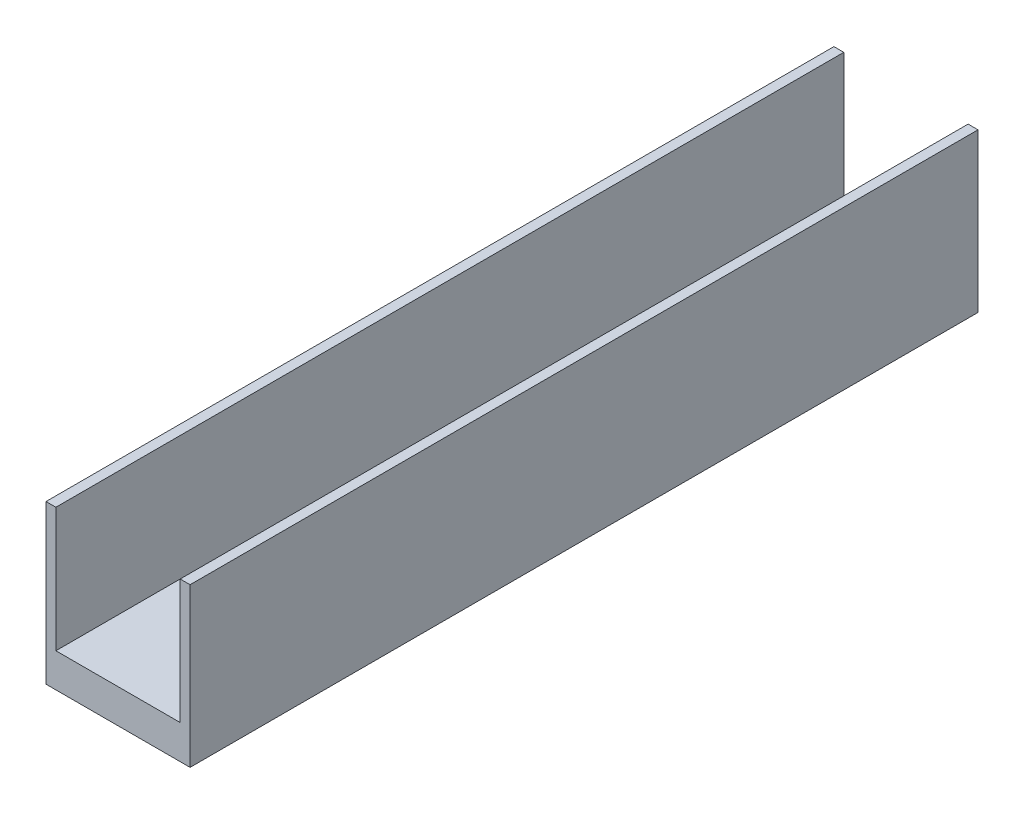
ISO-10303-21;
HEADER;
FILE_DESCRIPTION(('STEP AP214'),'2;1');
FILE_NAME('part.step','',(''),(''),'','','');
FILE_SCHEMA(('AUTOMOTIVE_DESIGN { 1 0 10303 214 1 1 1 1 }'));
ENDSEC;
DATA;
#1=APPLICATION_CONTEXT('core data for automotive mechanical design processes');
#2=APPLICATION_PROTOCOL_DEFINITION('international standard','automotive_design',2000,#1);
#3=PRODUCT_CONTEXT('',#1,'mechanical');
#4=PRODUCT('Part','Part','',(#3));
#5=PRODUCT_RELATED_PRODUCT_CATEGORY('part','',(#4));
#6=PRODUCT_DEFINITION_FORMATION('','',#4);
#7=PRODUCT_DEFINITION_CONTEXT('part definition',#1,'design');
#8=PRODUCT_DEFINITION('design','',#6,#7);
#9=PRODUCT_DEFINITION_SHAPE('','',#8);
#10=(LENGTH_UNIT() NAMED_UNIT(*) SI_UNIT(.MILLI.,.METRE.));
#11=(NAMED_UNIT(*) PLANE_ANGLE_UNIT() SI_UNIT($,.RADIAN.));
#12=(NAMED_UNIT(*) SI_UNIT($,.STERADIAN.) SOLID_ANGLE_UNIT());
#13=UNCERTAINTY_MEASURE_WITH_UNIT(LENGTH_MEASURE(1.E-05),#10,'distance_accuracy_value','');
#14=(GEOMETRIC_REPRESENTATION_CONTEXT(3) GLOBAL_UNCERTAINTY_ASSIGNED_CONTEXT((#13)) GLOBAL_UNIT_ASSIGNED_CONTEXT((#10,
#11,#12)) REPRESENTATION_CONTEXT('',''));
#15=CARTESIAN_POINT('',(0.,0.,0.));
#16=DIRECTION('',(0.,0.,1.));
#17=DIRECTION('',(1.,0.,0.));
#18=AXIS2_PLACEMENT_3D('',#15,#16,#17);
#19=CARTESIAN_POINT('',(80.9625,0.,442.7347));
#20=DIRECTION('',(0.,1.,0.));
#21=DIRECTION('',(-1.,0.,0.));
#22=AXIS2_PLACEMENT_3D('',#19,#20,#21);
#23=PLANE('',#22);
#24=DIRECTION('',(1.,0.,0.));
#25=VECTOR('',#24,1.);
#26=CARTESIAN_POINT('',(80.9625,0.,0.));
#27=LINE('',#26,#25);
#28=CARTESIAN_POINT('',(0.,0.,0.));
#29=VERTEX_POINT('',#28);
#30=CARTESIAN_POINT('',(80.9625,0.,0.));
#31=VERTEX_POINT('',#30);
#32=EDGE_CURVE('E129',#29,#31,#27,.T.);
#33=ORIENTED_EDGE('',*,*,#32,.T.);
#34=DIRECTION('',(0.,0.,-1.));
#35=VECTOR('',#34,1.);
#36=CARTESIAN_POINT('',(80.9625,0.,442.7347));
#37=LINE('',#36,#35);
#38=CARTESIAN_POINT('',(80.9625,0.,442.7347));
#39=VERTEX_POINT('',#38);
#40=EDGE_CURVE('E11',#39,#31,#37,.T.);
#41=ORIENTED_EDGE('',*,*,#40,.F.);
#42=DIRECTION('',(1.,0.,0.));
#43=VECTOR('',#42,1.);
#44=CARTESIAN_POINT('',(80.9625,0.,442.7347));
#45=LINE('',#44,#43);
#46=CARTESIAN_POINT('',(0.,0.,442.7347));
#47=VERTEX_POINT('',#46);
#48=EDGE_CURVE('E143',#47,#39,#45,.T.);
#49=ORIENTED_EDGE('',*,*,#48,.F.);
#50=DIRECTION('',(0.,0.,-1.));
#51=VECTOR('',#50,1.);
#52=CARTESIAN_POINT('',(0.,0.,442.7347));
#53=LINE('',#52,#51);
#54=EDGE_CURVE('E125',#47,#29,#53,.T.);
#55=ORIENTED_EDGE('',*,*,#54,.T.);
#56=EDGE_LOOP('',(#33,#41,#49,#55));
#57=FACE_BOUND('',#56,.T.);
#58=ADVANCED_FACE('F33',(#57),#23,.F.);
#59=CARTESIAN_POINT('',(80.9625,88.9,442.7347));
#60=DIRECTION('',(-1.,0.,0.));
#61=DIRECTION('',(0.,-1.,0.));
#62=AXIS2_PLACEMENT_3D('',#59,#60,#61);
#63=PLANE('',#62);
#64=DIRECTION('',(0.,1.,0.));
#65=VECTOR('',#64,1.);
#66=CARTESIAN_POINT('',(80.9625,88.9,0.));
#67=LINE('',#66,#65);
#68=CARTESIAN_POINT('',(80.9625,88.9,0.));
#69=VERTEX_POINT('',#68);
#70=EDGE_CURVE('E132',#31,#69,#67,.T.);
#71=ORIENTED_EDGE('',*,*,#70,.T.);
#72=DIRECTION('',(0.,0.,-1.));
#73=VECTOR('',#72,1.);
#74=CARTESIAN_POINT('',(80.9625,88.9,442.7347));
#75=LINE('',#74,#73);
#76=CARTESIAN_POINT('',(80.9625,88.9,442.7347));
#77=VERTEX_POINT('',#76);
#78=EDGE_CURVE('E41',#77,#69,#75,.T.);
#79=ORIENTED_EDGE('',*,*,#78,.F.);
#80=DIRECTION('',(0.,1.,0.));
#81=VECTOR('',#80,1.);
#82=CARTESIAN_POINT('',(80.9625,88.9,442.7347));
#83=LINE('',#82,#81);
#84=EDGE_CURVE('E92',#39,#77,#83,.T.);
#85=ORIENTED_EDGE('',*,*,#84,.F.);
#86=ORIENTED_EDGE('',*,*,#40,.T.);
#87=EDGE_LOOP('',(#71,#79,#85,#86));
#88=FACE_BOUND('',#87,.T.);
#89=ADVANCED_FACE('F178',(#88),#63,.F.);
#90=CARTESIAN_POINT('',(75.40625,88.9,442.7347));
#91=DIRECTION('',(0.,-1.,0.));
#92=DIRECTION('',(0.,0.,-1.));
#93=AXIS2_PLACEMENT_3D('',#90,#91,#92);
#94=PLANE('',#93);
#95=DIRECTION('',(-1.,0.,0.));
#96=VECTOR('',#95,1.);
#97=CARTESIAN_POINT('',(75.40625,88.9,0.));
#98=LINE('',#97,#96);
#99=CARTESIAN_POINT('',(75.40625,88.9,0.));
#100=VERTEX_POINT('',#99);
#101=EDGE_CURVE('E134',#69,#100,#98,.T.);
#102=ORIENTED_EDGE('',*,*,#101,.T.);
#103=DIRECTION('',(0.,0.,-1.));
#104=VECTOR('',#103,1.);
#105=CARTESIAN_POINT('',(75.40625,88.9,442.7347));
#106=LINE('',#105,#104);
#107=CARTESIAN_POINT('',(75.40625,88.9,442.7347));
#108=VERTEX_POINT('',#107);
#109=EDGE_CURVE('E150',#108,#100,#106,.T.);
#110=ORIENTED_EDGE('',*,*,#109,.F.);
#111=DIRECTION('',(-1.,0.,0.));
#112=VECTOR('',#111,1.);
#113=CARTESIAN_POINT('',(75.40625,88.9,442.7347));
#114=LINE('',#113,#112);
#115=EDGE_CURVE('E158',#77,#108,#114,.T.);
#116=ORIENTED_EDGE('',*,*,#115,.F.);
#117=ORIENTED_EDGE('',*,*,#78,.T.);
#118=EDGE_LOOP('',(#102,#110,#116,#117));
#119=FACE_BOUND('',#118,.T.);
#120=ADVANCED_FACE('F156',(#119),#94,.F.);
#121=CARTESIAN_POINT('',(75.40625,19.05,442.7347));
#122=DIRECTION('',(1.,0.,0.));
#123=DIRECTION('',(0.,0.,-1.));
#124=AXIS2_PLACEMENT_3D('',#121,#122,#123);
#125=PLANE('',#124);
#126=DIRECTION('',(0.,-1.,0.));
#127=VECTOR('',#126,1.);
#128=CARTESIAN_POINT('',(75.40625,19.05,0.));
#129=LINE('',#128,#127);
#130=CARTESIAN_POINT('',(75.40625,19.05,0.));
#131=VERTEX_POINT('',#130);
#132=EDGE_CURVE('E136',#100,#131,#129,.T.);
#133=ORIENTED_EDGE('',*,*,#132,.T.);
#134=DIRECTION('',(0.,0.,-1.));
#135=VECTOR('',#134,1.);
#136=CARTESIAN_POINT('',(75.40625,19.05,442.7347));
#137=LINE('',#136,#135);
#138=CARTESIAN_POINT('',(75.40625,19.05,442.7347));
#139=VERTEX_POINT('',#138);
#140=EDGE_CURVE('E147',#139,#131,#137,.T.);
#141=ORIENTED_EDGE('',*,*,#140,.F.);
#142=DIRECTION('',(0.,-1.,0.));
#143=VECTOR('',#142,1.);
#144=CARTESIAN_POINT('',(75.40625,19.05,442.7347));
#145=LINE('',#144,#143);
#146=EDGE_CURVE('E170',#108,#139,#145,.T.);
#147=ORIENTED_EDGE('',*,*,#146,.F.);
#148=ORIENTED_EDGE('',*,*,#109,.T.);
#149=EDGE_LOOP('',(#133,#141,#147,#148));
#150=FACE_BOUND('',#149,.T.);
#151=ADVANCED_FACE('F166',(#150),#125,.F.);
#152=CARTESIAN_POINT('',(5.55624999999999,19.05,442.7347));
#153=DIRECTION('',(0.,-1.,0.));
#154=DIRECTION('',(0.,0.,-1.));
#155=AXIS2_PLACEMENT_3D('',#152,#153,#154);
#156=PLANE('',#155);
#157=DIRECTION('',(-1.,0.,0.));
#158=VECTOR('',#157,1.);
#159=CARTESIAN_POINT('',(5.55624999999999,19.05,0.));
#160=LINE('',#159,#158);
#161=CARTESIAN_POINT('',(5.55624999999999,19.05,0.));
#162=VERTEX_POINT('',#161);
#163=EDGE_CURVE('E138',#131,#162,#160,.T.);
#164=ORIENTED_EDGE('',*,*,#163,.T.);
#165=DIRECTION('',(0.,0.,-1.));
#166=VECTOR('',#165,1.);
#167=CARTESIAN_POINT('',(5.55624999999999,19.05,442.7347));
#168=LINE('',#167,#166);
#169=CARTESIAN_POINT('',(5.55624999999999,19.05,442.7347));
#170=VERTEX_POINT('',#169);
#171=EDGE_CURVE('E120',#170,#162,#168,.T.);
#172=ORIENTED_EDGE('',*,*,#171,.F.);
#173=DIRECTION('',(-1.,0.,0.));
#174=VECTOR('',#173,1.);
#175=CARTESIAN_POINT('',(5.55624999999999,19.05,442.7347));
#176=LINE('',#175,#174);
#177=EDGE_CURVE('E111',#139,#170,#176,.T.);
#178=ORIENTED_EDGE('',*,*,#177,.F.);
#179=ORIENTED_EDGE('',*,*,#140,.T.);
#180=EDGE_LOOP('',(#164,#172,#178,#179));
#181=FACE_BOUND('',#180,.T.);
#182=ADVANCED_FACE('F169',(#181),#156,.F.);
#183=CARTESIAN_POINT('',(5.55624999999999,88.9,442.7347));
#184=DIRECTION('',(-1.,0.,0.));
#185=DIRECTION('',(0.,0.,1.));
#186=AXIS2_PLACEMENT_3D('',#183,#184,#185);
#187=PLANE('',#186);
#188=DIRECTION('',(0.,1.,0.));
#189=VECTOR('',#188,1.);
#190=CARTESIAN_POINT('',(5.55624999999999,88.9,0.));
#191=LINE('',#190,#189);
#192=CARTESIAN_POINT('',(5.55624999999999,88.9,0.));
#193=VERTEX_POINT('',#192);
#194=EDGE_CURVE('E119',#162,#193,#191,.T.);
#195=ORIENTED_EDGE('',*,*,#194,.T.);
#196=DIRECTION('',(0.,0.,-1.));
#197=VECTOR('',#196,1.);
#198=CARTESIAN_POINT('',(5.55624999999999,88.9,442.7347));
#199=LINE('',#198,#197);
#200=CARTESIAN_POINT('',(5.55624999999999,88.9,442.7347));
#201=VERTEX_POINT('',#200);
#202=EDGE_CURVE('E116',#201,#193,#199,.T.);
#203=ORIENTED_EDGE('',*,*,#202,.F.);
#204=DIRECTION('',(0.,1.,0.));
#205=VECTOR('',#204,1.);
#206=CARTESIAN_POINT('',(5.55624999999999,88.9,442.7347));
#207=LINE('',#206,#205);
#208=EDGE_CURVE('E105',#170,#201,#207,.T.);
#209=ORIENTED_EDGE('',*,*,#208,.F.);
#210=ORIENTED_EDGE('',*,*,#171,.T.);
#211=EDGE_LOOP('',(#195,#203,#209,#210));
#212=FACE_BOUND('',#211,.T.);
#213=ADVANCED_FACE('F117',(#212),#187,.F.);
#214=CARTESIAN_POINT('',(0.,88.9,442.7347));
#215=DIRECTION('',(0.,-1.,0.));
#216=DIRECTION('',(0.,0.,-1.));
#217=AXIS2_PLACEMENT_3D('',#214,#215,#216);
#218=PLANE('',#217);
#219=DIRECTION('',(-1.,0.,0.));
#220=VECTOR('',#219,1.);
#221=CARTESIAN_POINT('',(0.,88.9,0.));
#222=LINE('',#221,#220);
#223=CARTESIAN_POINT('',(0.,88.9,0.));
#224=VERTEX_POINT('',#223);
#225=EDGE_CURVE('E78',#193,#224,#222,.T.);
#226=ORIENTED_EDGE('',*,*,#225,.T.);
#227=DIRECTION('',(0.,0.,-1.));
#228=VECTOR('',#227,1.);
#229=CARTESIAN_POINT('',(0.,88.9,442.7347));
#230=LINE('',#229,#228);
#231=CARTESIAN_POINT('',(0.,88.9,442.7347));
#232=VERTEX_POINT('',#231);
#233=EDGE_CURVE('E121',#232,#224,#230,.T.);
#234=ORIENTED_EDGE('',*,*,#233,.F.);
#235=DIRECTION('',(-1.,0.,0.));
#236=VECTOR('',#235,1.);
#237=CARTESIAN_POINT('',(0.,88.9,442.7347));
#238=LINE('',#237,#236);
#239=EDGE_CURVE('E109',#201,#232,#238,.T.);
#240=ORIENTED_EDGE('',*,*,#239,.F.);
#241=ORIENTED_EDGE('',*,*,#202,.T.);
#242=EDGE_LOOP('',(#226,#234,#240,#241));
#243=FACE_BOUND('',#242,.T.);
#244=ADVANCED_FACE('F123',(#243),#218,.F.);
#245=CARTESIAN_POINT('',(0.,0.,442.7347));
#246=DIRECTION('',(1.,0.,0.));
#247=DIRECTION('',(0.,0.,-1.));
#248=AXIS2_PLACEMENT_3D('',#245,#246,#247);
#249=PLANE('',#248);
#250=DIRECTION('',(0.,-1.,0.));
#251=VECTOR('',#250,1.);
#252=CARTESIAN_POINT('',(0.,0.,0.));
#253=LINE('',#252,#251);
#254=EDGE_CURVE('E84',#224,#29,#253,.T.);
#255=ORIENTED_EDGE('',*,*,#254,.T.);
#256=ORIENTED_EDGE('',*,*,#54,.F.);
#257=DIRECTION('',(0.,-1.,0.));
#258=VECTOR('',#257,1.);
#259=CARTESIAN_POINT('',(0.,0.,442.7347));
#260=LINE('',#259,#258);
#261=EDGE_CURVE('E49',#232,#47,#260,.T.);
#262=ORIENTED_EDGE('',*,*,#261,.F.);
#263=ORIENTED_EDGE('',*,*,#233,.T.);
#264=EDGE_LOOP('',(#255,#256,#262,#263));
#265=FACE_BOUND('',#264,.T.);
#266=ADVANCED_FACE('F194',(#265),#249,.F.);
#267=CARTESIAN_POINT('',(0.,0.,442.7347));
#268=DIRECTION('',(0.,0.,-1.));
#269=DIRECTION('',(-1.,0.,0.));
#270=AXIS2_PLACEMENT_3D('',#267,#268,#269);
#271=PLANE('',#270);
#272=ORIENTED_EDGE('',*,*,#48,.T.);
#273=ORIENTED_EDGE('',*,*,#84,.T.);
#274=ORIENTED_EDGE('',*,*,#115,.T.);
#275=ORIENTED_EDGE('',*,*,#146,.T.);
#276=ORIENTED_EDGE('',*,*,#177,.T.);
#277=ORIENTED_EDGE('',*,*,#208,.T.);
#278=ORIENTED_EDGE('',*,*,#239,.T.);
#279=ORIENTED_EDGE('',*,*,#261,.T.);
#280=EDGE_LOOP('',(#272,#273,#274,#275,#276,#277,#278,#279));
#281=FACE_BOUND('',#280,.T.);
#282=ADVANCED_FACE('F107',(#281),#271,.F.);
#283=CARTESIAN_POINT('',(0.,0.,0.));
#284=DIRECTION('',(0.,0.,-1.));
#285=DIRECTION('',(-1.,0.,0.));
#286=AXIS2_PLACEMENT_3D('',#283,#284,#285);
#287=PLANE('',#286);
#288=ORIENTED_EDGE('',*,*,#32,.F.);
#289=ORIENTED_EDGE('',*,*,#254,.F.);
#290=ORIENTED_EDGE('',*,*,#225,.F.);
#291=ORIENTED_EDGE('',*,*,#194,.F.);
#292=ORIENTED_EDGE('',*,*,#163,.F.);
#293=ORIENTED_EDGE('',*,*,#132,.F.);
#294=ORIENTED_EDGE('',*,*,#101,.F.);
#295=ORIENTED_EDGE('',*,*,#70,.F.);
#296=EDGE_LOOP('',(#288,#289,#290,#291,#292,#293,#294,#295));
#297=FACE_BOUND('',#296,.T.);
#298=ADVANCED_FACE('F162',(#297),#287,.T.);
#299=CLOSED_SHELL('',(#58,#89,#120,#151,#182,#213,#244,#266,#282,#298));
#300=MANIFOLD_SOLID_BREP('B2',#299);
#301=ADVANCED_BREP_SHAPE_REPRESENTATION('',(#18,#300),#14);
#302=SHAPE_DEFINITION_REPRESENTATION(#9,#301);
ENDSEC;
END-ISO-10303-21;
